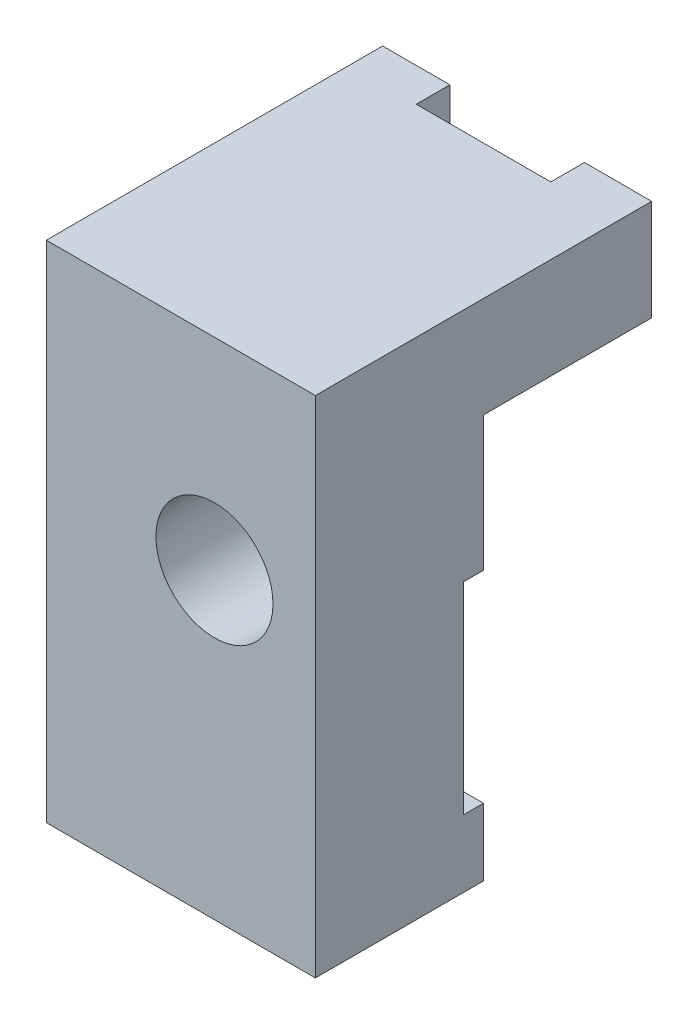
ISO-10303-21;
HEADER;
FILE_DESCRIPTION(('STEP AP214'),'2;1');
FILE_NAME('part.step','',(''),(''),'','','');
FILE_SCHEMA(('AUTOMOTIVE_DESIGN { 1 0 10303 214 1 1 1 1 }'));
ENDSEC;
DATA;
#1=APPLICATION_CONTEXT('core data for automotive mechanical design processes');
#2=APPLICATION_PROTOCOL_DEFINITION('international standard','automotive_design',2000,#1);
#3=PRODUCT_CONTEXT('',#1,'mechanical');
#4=PRODUCT('Part','Part','',(#3));
#5=PRODUCT_RELATED_PRODUCT_CATEGORY('part','',(#4));
#6=PRODUCT_DEFINITION_FORMATION('','',#4);
#7=PRODUCT_DEFINITION_CONTEXT('part definition',#1,'design');
#8=PRODUCT_DEFINITION('design','',#6,#7);
#9=PRODUCT_DEFINITION_SHAPE('','',#8);
#10=(LENGTH_UNIT() NAMED_UNIT(*) SI_UNIT(.MILLI.,.METRE.));
#11=(NAMED_UNIT(*) PLANE_ANGLE_UNIT() SI_UNIT($,.RADIAN.));
#12=(NAMED_UNIT(*) SI_UNIT($,.STERADIAN.) SOLID_ANGLE_UNIT());
#13=UNCERTAINTY_MEASURE_WITH_UNIT(LENGTH_MEASURE(1.E-05),#10,'distance_accuracy_value','');
#14=(GEOMETRIC_REPRESENTATION_CONTEXT(3) GLOBAL_UNCERTAINTY_ASSIGNED_CONTEXT((#13)) GLOBAL_UNIT_ASSIGNED_CONTEXT((#10,
#11,#12)) REPRESENTATION_CONTEXT('',''));
#15=CARTESIAN_POINT('',(0.,0.,0.));
#16=DIRECTION('',(0.,0.,1.));
#17=DIRECTION('',(1.,0.,0.));
#18=AXIS2_PLACEMENT_3D('',#15,#16,#17);
#19=CARTESIAN_POINT('',(-5.08,0.634999999999999,0.));
#20=DIRECTION('',(0.,1.,0.));
#21=DIRECTION('',(0.,0.,1.));
#22=AXIS2_PLACEMENT_3D('',#19,#20,#21);
#23=PLANE('',#22);
#24=DIRECTION('',(1.,0.,0.));
#25=VECTOR('',#24,1.);
#26=CARTESIAN_POINT('',(-5.08,0.634999999999999,0.));
#27=LINE('',#26,#25);
#28=CARTESIAN_POINT('',(-5.08,0.634999999999995,0.));
#29=VERTEX_POINT('',#28);
#30=CARTESIAN_POINT('',(-0.53840151515088,0.634999999999999,0.));
#31=VERTEX_POINT('',#30);
#32=EDGE_CURVE('E165',#29,#31,#27,.T.);
#33=ORIENTED_EDGE('',*,*,#32,.T.);
#34=DIRECTION('',(0.,0.,1.));
#35=VECTOR('',#34,1.);
#36=CARTESIAN_POINT('',(-0.53840151515088,0.635,-6.35));
#37=LINE('',#36,#35);
#38=CARTESIAN_POINT('',(-0.53840151515088,0.634999999999999,0.762));
#39=VERTEX_POINT('',#38);
#40=EDGE_CURVE('E11',#31,#39,#37,.T.);
#41=ORIENTED_EDGE('',*,*,#40,.T.);
#42=DIRECTION('',(1.,0.,0.));
#43=VECTOR('',#42,1.);
#44=CARTESIAN_POINT('',(-5.08,0.634999999999999,0.762));
#45=LINE('',#44,#43);
#46=CARTESIAN_POINT('',(-5.08,0.634999999999999,0.762));
#47=VERTEX_POINT('',#46);
#48=EDGE_CURVE('E158',#47,#39,#45,.T.);
#49=ORIENTED_EDGE('',*,*,#48,.F.);
#50=DIRECTION('',(0.,0.,1.));
#51=VECTOR('',#50,1.);
#52=CARTESIAN_POINT('',(-5.08,0.634999999999999,0.));
#53=LINE('',#52,#51);
#54=EDGE_CURVE('E56',#29,#47,#53,.T.);
#55=ORIENTED_EDGE('',*,*,#54,.F.);
#56=EDGE_LOOP('',(#33,#41,#49,#55));
#57=FACE_BOUND('',#56,.T.);
#58=ADVANCED_FACE('F33',(#57),#23,.F.);
#59=CARTESIAN_POINT('',(-5.08,-9.525,0.));
#60=DIRECTION('',(0.,0.,1.));
#61=DIRECTION('',(1.,0.,0.));
#62=AXIS2_PLACEMENT_3D('',#59,#60,#61);
#63=PLANE('',#62);
#64=DIRECTION('',(0.,-1.,0.));
#65=VECTOR('',#64,1.);
#66=CARTESIAN_POINT('',(-5.08,-9.525,0.));
#67=LINE('',#66,#65);
#68=CARTESIAN_POINT('',(-5.08,-6.985,0.));
#69=VERTEX_POINT('',#68);
#70=CARTESIAN_POINT('',(-5.08,-9.525,0.));
#71=VERTEX_POINT('',#70);
#72=EDGE_CURVE('E195',#69,#71,#67,.T.);
#73=ORIENTED_EDGE('',*,*,#72,.F.);
#74=DIRECTION('',(1.,0.,0.));
#75=VECTOR('',#74,1.);
#76=CARTESIAN_POINT('',(-5.08,-6.985,0.));
#77=LINE('',#76,#75);
#78=CARTESIAN_POINT('',(5.08,-6.985,0.));
#79=VERTEX_POINT('',#78);
#80=EDGE_CURVE('E177',#69,#79,#77,.T.);
#81=ORIENTED_EDGE('',*,*,#80,.T.);
#82=DIRECTION('',(0.,-1.,0.));
#83=VECTOR('',#82,1.);
#84=CARTESIAN_POINT('',(5.08,-9.525,0.));
#85=LINE('',#84,#83);
#86=CARTESIAN_POINT('',(5.08,-9.525,0.));
#87=VERTEX_POINT('',#86);
#88=EDGE_CURVE('E203',#79,#87,#85,.T.);
#89=ORIENTED_EDGE('',*,*,#88,.T.);
#90=DIRECTION('',(1.,0.,0.));
#91=VECTOR('',#90,1.);
#92=CARTESIAN_POINT('',(-5.08,-9.525,0.));
#93=LINE('',#92,#91);
#94=EDGE_CURVE('E206',#71,#87,#93,.T.);
#95=ORIENTED_EDGE('',*,*,#94,.F.);
#96=EDGE_LOOP('',(#73,#81,#89,#95));
#97=FACE_BOUND('',#96,.T.);
#98=ADVANCED_FACE('F314',(#97),#63,.F.);
#99=CARTESIAN_POINT('',(0.,0.,-6.35));
#100=DIRECTION('',(0.,0.,1.));
#101=DIRECTION('',(1.,0.,0.));
#102=AXIS2_PLACEMENT_3D('',#99,#100,#101);
#103=PLANE('',#102);
#104=DIRECTION('',(-1.,0.,0.));
#105=VECTOR('',#104,1.);
#106=CARTESIAN_POINT('',(-5.08,9.525,-6.35));
#107=LINE('',#106,#105);
#108=CARTESIAN_POINT('',(-2.54,9.525,-6.35));
#109=VERTEX_POINT('',#108);
#110=CARTESIAN_POINT('',(-5.08,9.525,-6.35));
#111=VERTEX_POINT('',#110);
#112=EDGE_CURVE('E230',#109,#111,#107,.T.);
#113=ORIENTED_EDGE('',*,*,#112,.F.);
#114=DIRECTION('',(0.,1.,0.));
#115=VECTOR('',#114,1.);
#116=CARTESIAN_POINT('',(-2.54,-9.525,-6.35));
#117=LINE('',#116,#115);
#118=CARTESIAN_POINT('',(-2.54,5.715,-6.35));
#119=VERTEX_POINT('',#118);
#120=EDGE_CURVE('E183',#119,#109,#117,.T.);
#121=ORIENTED_EDGE('',*,*,#120,.F.);
#122=DIRECTION('',(1.,0.,0.));
#123=VECTOR('',#122,1.);
#124=CARTESIAN_POINT('',(-5.08,5.715,-6.35));
#125=LINE('',#124,#123);
#126=CARTESIAN_POINT('',(-5.08,5.715,-6.35));
#127=VERTEX_POINT('',#126);
#128=EDGE_CURVE('E212',#127,#119,#125,.T.);
#129=ORIENTED_EDGE('',*,*,#128,.F.);
#130=DIRECTION('',(0.,-1.,0.));
#131=VECTOR('',#130,1.);
#132=CARTESIAN_POINT('',(-5.08,9.525,-6.35));
#133=LINE('',#132,#131);
#134=EDGE_CURVE('E209',#111,#127,#133,.T.);
#135=ORIENTED_EDGE('',*,*,#134,.F.);
#136=EDGE_LOOP('',(#113,#121,#129,#135));
#137=FACE_BOUND('',#136,.T.);
#138=ADVANCED_FACE('F261',(#137),#103,.F.);
#139=CARTESIAN_POINT('',(-5.08,9.525,6.35));
#140=DIRECTION('',(1.,0.,0.));
#141=DIRECTION('',(0.,1.,0.));
#142=AXIS2_PLACEMENT_3D('',#139,#140,#141);
#143=PLANE('',#142);
#144=DIRECTION('',(0.,-1.,0.));
#145=VECTOR('',#144,1.);
#146=CARTESIAN_POINT('',(-5.08,-6.985,0.762));
#147=LINE('',#146,#145);
#148=CARTESIAN_POINT('',(-5.08,-6.985,0.762));
#149=VERTEX_POINT('',#148);
#150=EDGE_CURVE('E295',#47,#149,#147,.T.);
#151=ORIENTED_EDGE('',*,*,#150,.T.);
#152=DIRECTION('',(0.,0.,-1.));
#153=VECTOR('',#152,1.);
#154=CARTESIAN_POINT('',(-5.08,-6.985,0.));
#155=LINE('',#154,#153);
#156=EDGE_CURVE('E298',#149,#69,#155,.T.);
#157=ORIENTED_EDGE('',*,*,#156,.T.);
#158=ORIENTED_EDGE('',*,*,#72,.T.);
#159=DIRECTION('',(0.,0.,-1.));
#160=VECTOR('',#159,1.);
#161=CARTESIAN_POINT('',(-5.08,-9.525,6.35));
#162=LINE('',#161,#160);
#163=CARTESIAN_POINT('',(-5.08,-9.525,6.35));
#164=VERTEX_POINT('',#163);
#165=EDGE_CURVE('E241',#164,#71,#162,.T.);
#166=ORIENTED_EDGE('',*,*,#165,.F.);
#167=DIRECTION('',(0.,-1.,0.));
#168=VECTOR('',#167,1.);
#169=CARTESIAN_POINT('',(-5.08,9.525,6.35));
#170=LINE('',#169,#168);
#171=CARTESIAN_POINT('',(-5.08,9.525,6.35));
#172=VERTEX_POINT('',#171);
#173=EDGE_CURVE('E215',#172,#164,#170,.T.);
#174=ORIENTED_EDGE('',*,*,#173,.F.);
#175=DIRECTION('',(0.,0.,-1.));
#176=VECTOR('',#175,1.);
#177=CARTESIAN_POINT('',(-5.08,9.525,6.35));
#178=LINE('',#177,#176);
#179=EDGE_CURVE('E225',#172,#111,#178,.T.);
#180=ORIENTED_EDGE('',*,*,#179,.T.);
#181=ORIENTED_EDGE('',*,*,#134,.T.);
#182=DIRECTION('',(0.,0.,1.));
#183=VECTOR('',#182,1.);
#184=CARTESIAN_POINT('',(-5.08,5.715,-6.35));
#185=LINE('',#184,#183);
#186=CARTESIAN_POINT('',(-5.08,5.715,0.));
#187=VERTEX_POINT('',#186);
#188=EDGE_CURVE('E192',#127,#187,#185,.T.);
#189=ORIENTED_EDGE('',*,*,#188,.T.);
#190=EDGE_CURVE('E197',#187,#29,#67,.T.);
#191=ORIENTED_EDGE('',*,*,#190,.T.);
#192=ORIENTED_EDGE('',*,*,#54,.T.);
#193=EDGE_LOOP('',(#151,#157,#158,#166,#174,#180,#181,#189,#191,#192));
#194=FACE_BOUND('',#193,.T.);
#195=ADVANCED_FACE('F35',(#194),#143,.F.);
#196=CARTESIAN_POINT('',(-5.08,-9.525,6.35));
#197=DIRECTION('',(0.,1.,0.));
#198=DIRECTION('',(0.,0.,1.));
#199=AXIS2_PLACEMENT_3D('',#196,#197,#198);
#200=PLANE('',#199);
#201=ORIENTED_EDGE('',*,*,#165,.T.);
#202=ORIENTED_EDGE('',*,*,#94,.T.);
#203=DIRECTION('',(0.,0.,-1.));
#204=VECTOR('',#203,1.);
#205=CARTESIAN_POINT('',(5.08,-9.525,6.35));
#206=LINE('',#205,#204);
#207=CARTESIAN_POINT('',(5.08,-9.525,6.35));
#208=VERTEX_POINT('',#207);
#209=EDGE_CURVE('E238',#208,#87,#206,.T.);
#210=ORIENTED_EDGE('',*,*,#209,.F.);
#211=DIRECTION('',(1.,0.,0.));
#212=VECTOR('',#211,1.);
#213=CARTESIAN_POINT('',(-5.08,-9.525,6.35));
#214=LINE('',#213,#212);
#215=EDGE_CURVE('E218',#164,#208,#214,.T.);
#216=ORIENTED_EDGE('',*,*,#215,.F.);
#217=EDGE_LOOP('',(#201,#202,#210,#216));
#218=FACE_BOUND('',#217,.T.);
#219=ADVANCED_FACE('F316',(#218),#200,.F.);
#220=CARTESIAN_POINT('',(5.08,9.525,6.35));
#221=DIRECTION('',(-1.,0.,0.));
#222=DIRECTION('',(0.,-1.,0.));
#223=AXIS2_PLACEMENT_3D('',#220,#221,#222);
#224=PLANE('',#223);
#225=ORIENTED_EDGE('',*,*,#88,.F.);
#226=DIRECTION('',(0.,0.,-1.));
#227=VECTOR('',#226,1.);
#228=CARTESIAN_POINT('',(5.08,-6.985,0.));
#229=LINE('',#228,#227);
#230=CARTESIAN_POINT('',(5.08,-6.985,0.762));
#231=VERTEX_POINT('',#230);
#232=EDGE_CURVE('E296',#231,#79,#229,.T.);
#233=ORIENTED_EDGE('',*,*,#232,.F.);
#234=DIRECTION('',(0.,-1.,0.));
#235=VECTOR('',#234,1.);
#236=CARTESIAN_POINT('',(5.08,-6.985,0.762));
#237=LINE('',#236,#235);
#238=CARTESIAN_POINT('',(5.08,0.635,0.762));
#239=VERTEX_POINT('',#238);
#240=EDGE_CURVE('E300',#239,#231,#237,.T.);
#241=ORIENTED_EDGE('',*,*,#240,.F.);
#242=DIRECTION('',(0.,0.,1.));
#243=VECTOR('',#242,1.);
#244=CARTESIAN_POINT('',(5.08,0.635,0.));
#245=LINE('',#244,#243);
#246=CARTESIAN_POINT('',(5.08,0.635,0.));
#247=VERTEX_POINT('',#246);
#248=EDGE_CURVE('E163',#247,#239,#245,.T.);
#249=ORIENTED_EDGE('',*,*,#248,.F.);
#250=CARTESIAN_POINT('',(5.08,5.715,0.));
#251=VERTEX_POINT('',#250);
#252=EDGE_CURVE('E196',#251,#247,#85,.T.);
#253=ORIENTED_EDGE('',*,*,#252,.F.);
#254=DIRECTION('',(0.,0.,1.));
#255=VECTOR('',#254,1.);
#256=CARTESIAN_POINT('',(5.08,5.715,-6.35));
#257=LINE('',#256,#255);
#258=CARTESIAN_POINT('',(5.08,5.715,-6.35));
#259=VERTEX_POINT('',#258);
#260=EDGE_CURVE('E185',#259,#251,#257,.T.);
#261=ORIENTED_EDGE('',*,*,#260,.F.);
#262=DIRECTION('',(0.,1.,0.));
#263=VECTOR('',#262,1.);
#264=CARTESIAN_POINT('',(5.08,9.525,-6.35));
#265=LINE('',#264,#263);
#266=CARTESIAN_POINT('',(5.08,9.525,-6.35));
#267=VERTEX_POINT('',#266);
#268=EDGE_CURVE('E228',#259,#267,#265,.T.);
#269=ORIENTED_EDGE('',*,*,#268,.T.);
#270=DIRECTION('',(0.,0.,-1.));
#271=VECTOR('',#270,1.);
#272=CARTESIAN_POINT('',(5.08,9.525,6.35));
#273=LINE('',#272,#271);
#274=CARTESIAN_POINT('',(5.08,9.525,6.35));
#275=VERTEX_POINT('',#274);
#276=EDGE_CURVE('E235',#275,#267,#273,.T.);
#277=ORIENTED_EDGE('',*,*,#276,.F.);
#278=DIRECTION('',(0.,1.,0.));
#279=VECTOR('',#278,1.);
#280=CARTESIAN_POINT('',(5.08,9.525,6.35));
#281=LINE('',#280,#279);
#282=EDGE_CURVE('E221',#208,#275,#281,.T.);
#283=ORIENTED_EDGE('',*,*,#282,.F.);
#284=ORIENTED_EDGE('',*,*,#209,.T.);
#285=EDGE_LOOP('',(#225,#233,#241,#249,#253,#261,#269,#277,#283,#284));
#286=FACE_BOUND('',#285,.T.);
#287=ADVANCED_FACE('F290',(#286),#224,.F.);
#288=CARTESIAN_POINT('',(-5.08,9.525,6.35));
#289=DIRECTION('',(0.,-1.,0.));
#290=DIRECTION('',(0.,0.,-1.));
#291=AXIS2_PLACEMENT_3D('',#288,#289,#290);
#292=PLANE('',#291);
#293=DIRECTION('',(1.,0.,0.));
#294=VECTOR('',#293,1.);
#295=CARTESIAN_POINT('',(-2.54,9.525,-5.08));
#296=LINE('',#295,#294);
#297=CARTESIAN_POINT('',(-2.54,9.525,-5.08));
#298=VERTEX_POINT('',#297);
#299=CARTESIAN_POINT('',(2.54,9.525,-5.08));
#300=VERTEX_POINT('',#299);
#301=EDGE_CURVE('E176',#298,#300,#296,.T.);
#302=ORIENTED_EDGE('',*,*,#301,.F.);
#303=DIRECTION('',(0.,0.,1.));
#304=VECTOR('',#303,1.);
#305=CARTESIAN_POINT('',(-2.54,9.525,-6.35));
#306=LINE('',#305,#304);
#307=EDGE_CURVE('E173',#109,#298,#306,.T.);
#308=ORIENTED_EDGE('',*,*,#307,.F.);
#309=ORIENTED_EDGE('',*,*,#112,.T.);
#310=ORIENTED_EDGE('',*,*,#179,.F.);
#311=DIRECTION('',(-1.,0.,0.));
#312=VECTOR('',#311,1.);
#313=CARTESIAN_POINT('',(-5.08,9.525,6.35));
#314=LINE('',#313,#312);
#315=EDGE_CURVE('E223',#275,#172,#314,.T.);
#316=ORIENTED_EDGE('',*,*,#315,.F.);
#317=ORIENTED_EDGE('',*,*,#276,.T.);
#318=CARTESIAN_POINT('',(2.54,9.525,-6.35));
#319=VERTEX_POINT('',#318);
#320=EDGE_CURVE('E219',#267,#319,#107,.T.);
#321=ORIENTED_EDGE('',*,*,#320,.T.);
#322=DIRECTION('',(0.,0.,-1.));
#323=VECTOR('',#322,1.);
#324=CARTESIAN_POINT('',(2.54,9.525,-6.35));
#325=LINE('',#324,#323);
#326=EDGE_CURVE('E180',#300,#319,#325,.T.);
#327=ORIENTED_EDGE('',*,*,#326,.F.);
#328=EDGE_LOOP('',(#302,#308,#309,#310,#316,#317,#321,#327));
#329=FACE_BOUND('',#328,.T.);
#330=ADVANCED_FACE('F266',(#329),#292,.F.);
#331=CARTESIAN_POINT('',(0.,0.,6.35));
#332=DIRECTION('',(0.,0.,1.));
#333=DIRECTION('',(1.,0.,0.));
#334=AXIS2_PLACEMENT_3D('',#331,#332,#333);
#335=PLANE('',#334);
#336=CARTESIAN_POINT('',(1.27,1.905,6.35));
#337=DIRECTION('',(0.,0.,1.));
#338=DIRECTION('',(1.,0.,0.));
#339=AXIS2_PLACEMENT_3D('',#336,#337,#338);
#340=CIRCLE('',#339,2.2098);
#341=CARTESIAN_POINT('',(3.4798,1.905,6.35));
#342=VERTEX_POINT('',#341);
#343=EDGE_CURVE('E159',#342,#342,#340,.T.);
#344=ORIENTED_EDGE('',*,*,#343,.F.);
#345=EDGE_LOOP('',(#344));
#346=FACE_BOUND('',#345,.T.);
#347=ORIENTED_EDGE('',*,*,#173,.T.);
#348=ORIENTED_EDGE('',*,*,#215,.T.);
#349=ORIENTED_EDGE('',*,*,#282,.T.);
#350=ORIENTED_EDGE('',*,*,#315,.T.);
#351=EDGE_LOOP('',(#347,#348,#349,#350));
#352=FACE_BOUND('',#351,.T.);
#353=ADVANCED_FACE('F273',(#346,#352),#335,.T.);
#354=CARTESIAN_POINT('',(2.54,5.715,-6.35));
#355=VERTEX_POINT('',#354);
#356=EDGE_CURVE('E200',#355,#259,#125,.T.);
#357=ORIENTED_EDGE('',*,*,#356,.F.);
#358=DIRECTION('',(0.,1.,0.));
#359=VECTOR('',#358,1.);
#360=CARTESIAN_POINT('',(2.54,-9.525,-6.35));
#361=LINE('',#360,#359);
#362=EDGE_CURVE('E186',#355,#319,#361,.T.);
#363=ORIENTED_EDGE('',*,*,#362,.T.);
#364=ORIENTED_EDGE('',*,*,#320,.F.);
#365=ORIENTED_EDGE('',*,*,#268,.F.);
#366=EDGE_LOOP('',(#357,#363,#364,#365));
#367=FACE_BOUND('',#366,.T.);
#368=ADVANCED_FACE('F283',(#367),#103,.F.);
#369=CARTESIAN_POINT('',(3.07840151515088,0.634999999999999,0.));
#370=VERTEX_POINT('',#369);
#371=EDGE_CURVE('E168',#370,#247,#27,.T.);
#372=ORIENTED_EDGE('',*,*,#371,.F.);
#373=CARTESIAN_POINT('',(1.27,1.905,0.));
#374=DIRECTION('',(0.,0.,1.));
#375=DIRECTION('',(1.,0.,0.));
#376=AXIS2_PLACEMENT_3D('',#373,#374,#375);
#377=CIRCLE('',#376,2.2098);
#378=EDGE_CURVE('E48',#370,#31,#377,.T.);
#379=ORIENTED_EDGE('',*,*,#378,.T.);
#380=ORIENTED_EDGE('',*,*,#32,.F.);
#381=ORIENTED_EDGE('',*,*,#190,.F.);
#382=DIRECTION('',(1.,0.,0.));
#383=VECTOR('',#382,1.);
#384=CARTESIAN_POINT('',(-5.08,5.715,0.));
#385=LINE('',#384,#383);
#386=EDGE_CURVE('E210',#187,#251,#385,.T.);
#387=ORIENTED_EDGE('',*,*,#386,.T.);
#388=ORIENTED_EDGE('',*,*,#252,.T.);
#389=EDGE_LOOP('',(#372,#379,#380,#381,#387,#388));
#390=FACE_BOUND('',#389,.T.);
#391=ADVANCED_FACE('F292',(#390),#63,.F.);
#392=CARTESIAN_POINT('',(-5.08,5.715,-6.35));
#393=DIRECTION('',(0.,1.,0.));
#394=DIRECTION('',(0.,0.,1.));
#395=AXIS2_PLACEMENT_3D('',#392,#393,#394);
#396=PLANE('',#395);
#397=ORIENTED_EDGE('',*,*,#128,.T.);
#398=DIRECTION('',(0.,0.,1.));
#399=VECTOR('',#398,1.);
#400=CARTESIAN_POINT('',(-2.54,5.715,-6.35));
#401=LINE('',#400,#399);
#402=CARTESIAN_POINT('',(-2.54,5.715,-5.08));
#403=VERTEX_POINT('',#402);
#404=EDGE_CURVE('E150',#119,#403,#401,.T.);
#405=ORIENTED_EDGE('',*,*,#404,.T.);
#406=DIRECTION('',(1.,0.,0.));
#407=VECTOR('',#406,1.);
#408=CARTESIAN_POINT('',(-5.08,5.715,-5.08));
#409=LINE('',#408,#407);
#410=CARTESIAN_POINT('',(2.54,5.715,-5.08));
#411=VERTEX_POINT('',#410);
#412=EDGE_CURVE('E244',#403,#411,#409,.T.);
#413=ORIENTED_EDGE('',*,*,#412,.T.);
#414=DIRECTION('',(0.,0.,-1.));
#415=VECTOR('',#414,1.);
#416=CARTESIAN_POINT('',(2.54,5.715,-6.35));
#417=LINE('',#416,#415);
#418=EDGE_CURVE('E247',#411,#355,#417,.T.);
#419=ORIENTED_EDGE('',*,*,#418,.T.);
#420=ORIENTED_EDGE('',*,*,#356,.T.);
#421=ORIENTED_EDGE('',*,*,#260,.T.);
#422=ORIENTED_EDGE('',*,*,#386,.F.);
#423=ORIENTED_EDGE('',*,*,#188,.F.);
#424=EDGE_LOOP('',(#397,#405,#413,#419,#420,#421,#422,#423));
#425=FACE_BOUND('',#424,.T.);
#426=ADVANCED_FACE('F252',(#425),#396,.F.);
#427=CARTESIAN_POINT('',(-2.54,-9.525,-6.35));
#428=DIRECTION('',(-1.,0.,0.));
#429=DIRECTION('',(0.,0.,1.));
#430=AXIS2_PLACEMENT_3D('',#427,#428,#429);
#431=PLANE('',#430);
#432=ORIENTED_EDGE('',*,*,#120,.T.);
#433=ORIENTED_EDGE('',*,*,#307,.T.);
#434=DIRECTION('',(0.,1.,0.));
#435=VECTOR('',#434,1.);
#436=CARTESIAN_POINT('',(-2.54,-9.525,-5.08));
#437=LINE('',#436,#435);
#438=EDGE_CURVE('E182',#403,#298,#437,.T.);
#439=ORIENTED_EDGE('',*,*,#438,.F.);
#440=ORIENTED_EDGE('',*,*,#404,.F.);
#441=EDGE_LOOP('',(#432,#433,#439,#440));
#442=FACE_BOUND('',#441,.T.);
#443=ADVANCED_FACE('F257',(#442),#431,.F.);
#444=CARTESIAN_POINT('',(2.54,-9.525,-6.35));
#445=DIRECTION('',(1.,0.,0.));
#446=DIRECTION('',(0.,0.,-1.));
#447=AXIS2_PLACEMENT_3D('',#444,#445,#446);
#448=PLANE('',#447);
#449=DIRECTION('',(0.,1.,0.));
#450=VECTOR('',#449,1.);
#451=CARTESIAN_POINT('',(2.54,-9.525,-5.08));
#452=LINE('',#451,#450);
#453=EDGE_CURVE('E189',#411,#300,#452,.T.);
#454=ORIENTED_EDGE('',*,*,#453,.T.);
#455=ORIENTED_EDGE('',*,*,#326,.T.);
#456=ORIENTED_EDGE('',*,*,#362,.F.);
#457=ORIENTED_EDGE('',*,*,#418,.F.);
#458=EDGE_LOOP('',(#454,#455,#456,#457));
#459=FACE_BOUND('',#458,.T.);
#460=ADVANCED_FACE('F286',(#459),#448,.F.);
#461=CARTESIAN_POINT('',(-2.54,-9.525,-5.08));
#462=DIRECTION('',(0.,0.,1.));
#463=DIRECTION('',(1.,0.,0.));
#464=AXIS2_PLACEMENT_3D('',#461,#462,#463);
#465=PLANE('',#464);
#466=ORIENTED_EDGE('',*,*,#438,.T.);
#467=ORIENTED_EDGE('',*,*,#301,.T.);
#468=ORIENTED_EDGE('',*,*,#453,.F.);
#469=ORIENTED_EDGE('',*,*,#412,.F.);
#470=EDGE_LOOP('',(#466,#467,#468,#469));
#471=FACE_BOUND('',#470,.T.);
#472=ADVANCED_FACE('F341',(#471),#465,.F.);
#473=CARTESIAN_POINT('',(-5.08,-6.985,0.));
#474=DIRECTION('',(0.,-1.,0.));
#475=DIRECTION('',(0.,0.,-1.));
#476=AXIS2_PLACEMENT_3D('',#473,#474,#475);
#477=PLANE('',#476);
#478=ORIENTED_EDGE('',*,*,#232,.T.);
#479=ORIENTED_EDGE('',*,*,#80,.F.);
#480=ORIENTED_EDGE('',*,*,#156,.F.);
#481=DIRECTION('',(1.,0.,0.));
#482=VECTOR('',#481,1.);
#483=CARTESIAN_POINT('',(-5.08,-6.985,0.762));
#484=LINE('',#483,#482);
#485=EDGE_CURVE('E167',#149,#231,#484,.T.);
#486=ORIENTED_EDGE('',*,*,#485,.T.);
#487=EDGE_LOOP('',(#478,#479,#480,#486));
#488=FACE_BOUND('',#487,.T.);
#489=ADVANCED_FACE('F311',(#488),#477,.F.);
#490=CARTESIAN_POINT('',(-5.08,-6.985,0.762));
#491=DIRECTION('',(0.,0.,1.));
#492=DIRECTION('',(1.,0.,0.));
#493=AXIS2_PLACEMENT_3D('',#490,#491,#492);
#494=PLANE('',#493);
#495=ORIENTED_EDGE('',*,*,#48,.T.);
#496=CARTESIAN_POINT('',(1.27,1.905,0.762));
#497=DIRECTION('',(0.,0.,1.));
#498=DIRECTION('',(1.,0.,0.));
#499=AXIS2_PLACEMENT_3D('',#496,#497,#498);
#500=CIRCLE('',#499,2.2098);
#501=CARTESIAN_POINT('',(3.07840151515088,0.635000000000001,0.762000000000001));
#502=VERTEX_POINT('',#501);
#503=EDGE_CURVE('E146',#39,#502,#500,.T.);
#504=ORIENTED_EDGE('',*,*,#503,.T.);
#505=EDGE_CURVE('E155',#502,#239,#45,.T.);
#506=ORIENTED_EDGE('',*,*,#505,.T.);
#507=ORIENTED_EDGE('',*,*,#240,.T.);
#508=ORIENTED_EDGE('',*,*,#485,.F.);
#509=ORIENTED_EDGE('',*,*,#150,.F.);
#510=EDGE_LOOP('',(#495,#504,#506,#507,#508,#509));
#511=FACE_BOUND('',#510,.T.);
#512=ADVANCED_FACE('F153',(#511),#494,.F.);
#513=ORIENTED_EDGE('',*,*,#505,.F.);
#514=DIRECTION('',(0.,0.,1.));
#515=VECTOR('',#514,1.);
#516=CARTESIAN_POINT('',(3.07840151515088,0.635000000000001,-6.35));
#517=LINE('',#516,#515);
#518=EDGE_CURVE('E41',#502,#370,#517,.F.);
#519=ORIENTED_EDGE('',*,*,#518,.T.);
#520=ORIENTED_EDGE('',*,*,#371,.T.);
#521=ORIENTED_EDGE('',*,*,#248,.T.);
#522=EDGE_LOOP('',(#513,#519,#520,#521));
#523=FACE_BOUND('',#522,.T.);
#524=ADVANCED_FACE('F161',(#523),#23,.F.);
#525=CARTESIAN_POINT('',(1.27,1.905,-6.35));
#526=DIRECTION('',(0.,0.,1.));
#527=DIRECTION('',(1.,0.,0.));
#528=AXIS2_PLACEMENT_3D('',#525,#526,#527);
#529=CYLINDRICAL_SURFACE('',#528,2.2098);
#530=ORIENTED_EDGE('',*,*,#343,.T.);
#531=EDGE_LOOP('',(#530));
#532=FACE_BOUND('',#531,.T.);
#533=ORIENTED_EDGE('',*,*,#378,.F.);
#534=ORIENTED_EDGE('',*,*,#518,.F.);
#535=ORIENTED_EDGE('',*,*,#503,.F.);
#536=ORIENTED_EDGE('',*,*,#40,.F.);
#537=EDGE_LOOP('',(#533,#534,#535,#536));
#538=FACE_BOUND('',#537,.T.);
#539=ADVANCED_FACE('F145',(#532,#538),#529,.F.);
#540=CLOSED_SHELL('',(#58,#98,#138,#195,#219,#287,#330,#353,#368,#391,#426,#443,#460,#472,#489,
#512,#524,#539));
#541=MANIFOLD_SOLID_BREP('B2',#540);
#542=ADVANCED_BREP_SHAPE_REPRESENTATION('',(#18,#541),#14);
#543=SHAPE_DEFINITION_REPRESENTATION(#9,#542);
ENDSEC;
END-ISO-10303-21;
